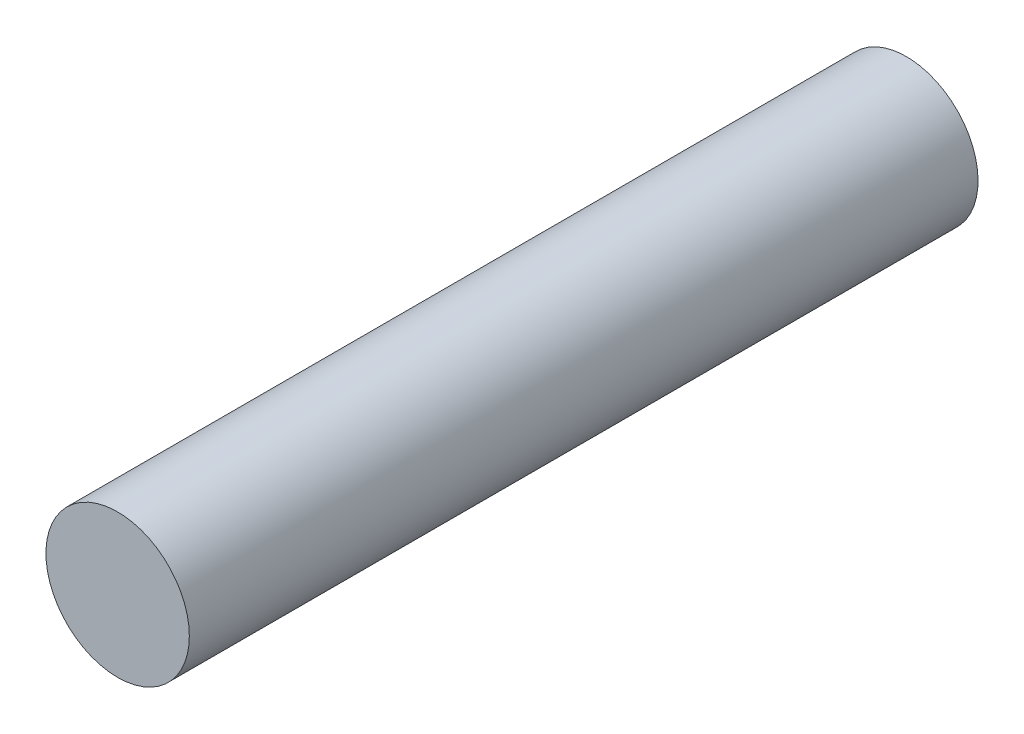
ISO-10303-21;
HEADER;
FILE_DESCRIPTION(('STEP AP214'),'2;1');
FILE_NAME('part.step','',(''),(''),'','','');
FILE_SCHEMA(('AUTOMOTIVE_DESIGN { 1 0 10303 214 1 1 1 1 }'));
ENDSEC;
DATA;
#1=APPLICATION_CONTEXT('core data for automotive mechanical design processes');
#2=APPLICATION_PROTOCOL_DEFINITION('international standard','automotive_design',2000,#1);
#3=PRODUCT_CONTEXT('',#1,'mechanical');
#4=PRODUCT('Part','Part','',(#3));
#5=PRODUCT_RELATED_PRODUCT_CATEGORY('part','',(#4));
#6=PRODUCT_DEFINITION_FORMATION('','',#4);
#7=PRODUCT_DEFINITION_CONTEXT('part definition',#1,'design');
#8=PRODUCT_DEFINITION('design','',#6,#7);
#9=PRODUCT_DEFINITION_SHAPE('','',#8);
#10=(LENGTH_UNIT() NAMED_UNIT(*) SI_UNIT(.MILLI.,.METRE.));
#11=(NAMED_UNIT(*) PLANE_ANGLE_UNIT() SI_UNIT($,.RADIAN.));
#12=(NAMED_UNIT(*) SI_UNIT($,.STERADIAN.) SOLID_ANGLE_UNIT());
#13=UNCERTAINTY_MEASURE_WITH_UNIT(LENGTH_MEASURE(1.E-05),#10,'distance_accuracy_value','');
#14=(GEOMETRIC_REPRESENTATION_CONTEXT(3) GLOBAL_UNCERTAINTY_ASSIGNED_CONTEXT((#13)) GLOBAL_UNIT_ASSIGNED_CONTEXT((#10,
#11,#12)) REPRESENTATION_CONTEXT('',''));
#15=CARTESIAN_POINT('',(0.,0.,0.));
#16=DIRECTION('',(0.,0.,1.));
#17=DIRECTION('',(1.,0.,0.));
#18=AXIS2_PLACEMENT_3D('',#15,#16,#17);
#19=CARTESIAN_POINT('',(7.99999999999999,30.,33.4852813742386));
#20=DIRECTION('',(0.,0.,-1.));
#21=DIRECTION('',(-1.,0.,0.));
#22=AXIS2_PLACEMENT_3D('',#19,#20,#21);
#23=CYLINDRICAL_SURFACE('',#22,3.);
#24=CARTESIAN_POINT('',(7.99999999999999,30.,25.));
#25=DIRECTION('',(0.,0.,1.));
#26=DIRECTION('',(1.,0.,0.));
#27=AXIS2_PLACEMENT_3D('',#24,#25,#26);
#28=CIRCLE('',#27,3.);
#29=CARTESIAN_POINT('',(11.,30.,25.));
#30=VERTEX_POINT('',#29);
#31=EDGE_CURVE('E10',#30,#30,#28,.T.);
#32=ORIENTED_EDGE('',*,*,#31,.F.);
#33=EDGE_LOOP('',(#32));
#34=FACE_BOUND('',#33,.T.);
#35=CARTESIAN_POINT('',(7.99999999999999,30.,-8.));
#36=DIRECTION('',(0.,0.,1.));
#37=DIRECTION('',(0.,-1.,0.));
#38=AXIS2_PLACEMENT_3D('',#35,#36,#37);
#39=CIRCLE('',#38,3.);
#40=CARTESIAN_POINT('',(7.99999999999999,27.,-8.));
#41=VERTEX_POINT('',#40);
#42=EDGE_CURVE('E37',#41,#41,#39,.F.);
#43=ORIENTED_EDGE('',*,*,#42,.F.);
#44=EDGE_LOOP('',(#43));
#45=FACE_BOUND('',#44,.T.);
#46=ADVANCED_FACE('F30',(#34,#45),#23,.T.);
#47=CARTESIAN_POINT('',(0.,0.,25.));
#48=DIRECTION('',(0.,0.,1.));
#49=DIRECTION('',(1.,0.,0.));
#50=AXIS2_PLACEMENT_3D('',#47,#48,#49);
#51=PLANE('',#50);
#52=ORIENTED_EDGE('',*,*,#31,.T.);
#53=EDGE_LOOP('',(#52));
#54=FACE_BOUND('',#53,.T.);
#55=ADVANCED_FACE('F32',(#54),#51,.T.);
#56=CARTESIAN_POINT('',(-43.3753106556489,65.0861645365894,-8.));
#57=DIRECTION('',(0.,0.,1.));
#58=DIRECTION('',(0.,-1.,0.));
#59=AXIS2_PLACEMENT_3D('',#56,#57,#58);
#60=PLANE('',#59);
#61=ORIENTED_EDGE('',*,*,#42,.T.);
#62=EDGE_LOOP('',(#61));
#63=FACE_BOUND('',#62,.T.);
#64=ADVANCED_FACE('F43',(#63),#60,.F.);
#65=CLOSED_SHELL('',(#46,#55,#64));
#66=MANIFOLD_SOLID_BREP('B2',#65);
#67=ADVANCED_BREP_SHAPE_REPRESENTATION('',(#18,#66),#14);
#68=SHAPE_DEFINITION_REPRESENTATION(#9,#67);
ENDSEC;
END-ISO-10303-21;
